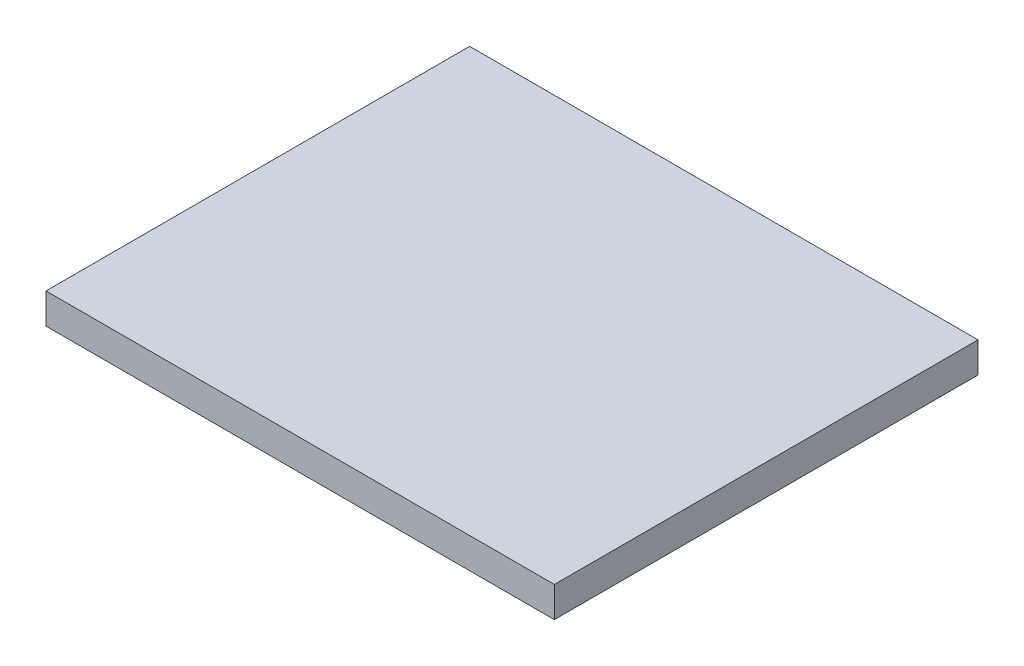
ISO-10303-21;
HEADER;
FILE_DESCRIPTION(('STEP AP214'),'2;1');
FILE_NAME('part.step','',(''),(''),'','','');
FILE_SCHEMA(('AUTOMOTIVE_DESIGN { 1 0 10303 214 1 1 1 1 }'));
ENDSEC;
DATA;
#1=APPLICATION_CONTEXT('core data for automotive mechanical design processes');
#2=APPLICATION_PROTOCOL_DEFINITION('international standard','automotive_design',2000,#1);
#3=PRODUCT_CONTEXT('',#1,'mechanical');
#4=PRODUCT('Part','Part','',(#3));
#5=PRODUCT_RELATED_PRODUCT_CATEGORY('part','',(#4));
#6=PRODUCT_DEFINITION_FORMATION('','',#4);
#7=PRODUCT_DEFINITION_CONTEXT('part definition',#1,'design');
#8=PRODUCT_DEFINITION('design','',#6,#7);
#9=PRODUCT_DEFINITION_SHAPE('','',#8);
#10=(LENGTH_UNIT() NAMED_UNIT(*) SI_UNIT(.MILLI.,.METRE.));
#11=(NAMED_UNIT(*) PLANE_ANGLE_UNIT() SI_UNIT($,.RADIAN.));
#12=(NAMED_UNIT(*) SI_UNIT($,.STERADIAN.) SOLID_ANGLE_UNIT());
#13=UNCERTAINTY_MEASURE_WITH_UNIT(LENGTH_MEASURE(1.E-05),#10,'distance_accuracy_value','');
#14=(GEOMETRIC_REPRESENTATION_CONTEXT(3) GLOBAL_UNCERTAINTY_ASSIGNED_CONTEXT((#13)) GLOBAL_UNIT_ASSIGNED_CONTEXT((#10,
#11,#12)) REPRESENTATION_CONTEXT('',''));
#15=CARTESIAN_POINT('',(0.,0.,0.));
#16=DIRECTION('',(0.,0.,1.));
#17=DIRECTION('',(1.,0.,0.));
#18=AXIS2_PLACEMENT_3D('',#15,#16,#17);
#19=CARTESIAN_POINT('',(-68.0490748205367,18.,-47.6831330731718));
#20=DIRECTION('',(1.,0.,0.));
#21=DIRECTION('',(0.,0.,-1.));
#22=AXIS2_PLACEMENT_3D('',#19,#20,#21);
#23=PLANE('',#22);
#24=DIRECTION('',(0.,0.,1.));
#25=VECTOR('',#24,1.);
#26=CARTESIAN_POINT('',(-68.0490748205367,0.,-47.6831330731718));
#27=LINE('',#26,#25);
#28=CARTESIAN_POINT('',(-68.0490748205367,0.,-47.6831330731718));
#29=VERTEX_POINT('',#28);
#30=CARTESIAN_POINT('',(-68.0490748205367,0.,202.316866926828));
#31=VERTEX_POINT('',#30);
#32=EDGE_CURVE('E95',#29,#31,#27,.T.);
#33=ORIENTED_EDGE('',*,*,#32,.T.);
#34=DIRECTION('',(0.,-1.,0.));
#35=VECTOR('',#34,1.);
#36=CARTESIAN_POINT('',(-68.0490748205367,18.,202.316866926828));
#37=LINE('',#36,#35);
#38=CARTESIAN_POINT('',(-68.0490748205367,18.,202.316866926828));
#39=VERTEX_POINT('',#38);
#40=EDGE_CURVE('E11',#39,#31,#37,.T.);
#41=ORIENTED_EDGE('',*,*,#40,.F.);
#42=DIRECTION('',(0.,0.,1.));
#43=VECTOR('',#42,1.);
#44=CARTESIAN_POINT('',(-68.0490748205367,18.,-47.6831330731718));
#45=LINE('',#44,#43);
#46=CARTESIAN_POINT('',(-68.0490748205367,18.,-47.6831330731718));
#47=VERTEX_POINT('',#46);
#48=EDGE_CURVE('E83',#47,#39,#45,.T.);
#49=ORIENTED_EDGE('',*,*,#48,.F.);
#50=DIRECTION('',(0.,-1.,0.));
#51=VECTOR('',#50,1.);
#52=CARTESIAN_POINT('',(-68.0490748205367,18.,-47.6831330731718));
#53=LINE('',#52,#51);
#54=EDGE_CURVE('E91',#47,#29,#53,.T.);
#55=ORIENTED_EDGE('',*,*,#54,.T.);
#56=EDGE_LOOP('',(#33,#41,#49,#55));
#57=FACE_BOUND('',#56,.T.);
#58=ADVANCED_FACE('F32',(#57),#23,.F.);
#59=CARTESIAN_POINT('',(-68.0490748205367,18.,202.316866926828));
#60=DIRECTION('',(0.,0.,-1.));
#61=DIRECTION('',(-1.,0.,0.));
#62=AXIS2_PLACEMENT_3D('',#59,#60,#61);
#63=PLANE('',#62);
#64=DIRECTION('',(1.,0.,0.));
#65=VECTOR('',#64,1.);
#66=CARTESIAN_POINT('',(-68.0490748205367,0.,202.316866926828));
#67=LINE('',#66,#65);
#68=CARTESIAN_POINT('',(231.950925179463,0.,202.316866926828));
#69=VERTEX_POINT('',#68);
#70=EDGE_CURVE('E87',#31,#69,#67,.T.);
#71=ORIENTED_EDGE('',*,*,#70,.T.);
#72=DIRECTION('',(0.,-1.,0.));
#73=VECTOR('',#72,1.);
#74=CARTESIAN_POINT('',(231.950925179463,18.,202.316866926828));
#75=LINE('',#74,#73);
#76=CARTESIAN_POINT('',(231.950925179463,18.,202.316866926828));
#77=VERTEX_POINT('',#76);
#78=EDGE_CURVE('E40',#77,#69,#75,.T.);
#79=ORIENTED_EDGE('',*,*,#78,.F.);
#80=DIRECTION('',(1.,0.,0.));
#81=VECTOR('',#80,1.);
#82=CARTESIAN_POINT('',(-68.0490748205367,18.,202.316866926828));
#83=LINE('',#82,#81);
#84=EDGE_CURVE('E78',#39,#77,#83,.T.);
#85=ORIENTED_EDGE('',*,*,#84,.F.);
#86=ORIENTED_EDGE('',*,*,#40,.T.);
#87=EDGE_LOOP('',(#71,#79,#85,#86));
#88=FACE_BOUND('',#87,.T.);
#89=ADVANCED_FACE('F86',(#88),#63,.F.);
#90=CARTESIAN_POINT('',(231.950925179463,18.,-47.6831330731718));
#91=DIRECTION('',(-1.,0.,0.));
#92=DIRECTION('',(0.,0.,1.));
#93=AXIS2_PLACEMENT_3D('',#90,#91,#92);
#94=PLANE('',#93);
#95=DIRECTION('',(0.,0.,-1.));
#96=VECTOR('',#95,1.);
#97=CARTESIAN_POINT('',(231.950925179463,0.,-47.6831330731718));
#98=LINE('',#97,#96);
#99=CARTESIAN_POINT('',(231.950925179463,0.,-47.6831330731718));
#100=VERTEX_POINT('',#99);
#101=EDGE_CURVE('E65',#69,#100,#98,.T.);
#102=ORIENTED_EDGE('',*,*,#101,.T.);
#103=DIRECTION('',(0.,-1.,0.));
#104=VECTOR('',#103,1.);
#105=CARTESIAN_POINT('',(231.950925179463,18.,-47.6831330731718));
#106=LINE('',#105,#104);
#107=CARTESIAN_POINT('',(231.950925179463,18.,-47.6831330731718));
#108=VERTEX_POINT('',#107);
#109=EDGE_CURVE('E88',#108,#100,#106,.T.);
#110=ORIENTED_EDGE('',*,*,#109,.F.);
#111=DIRECTION('',(0.,0.,-1.));
#112=VECTOR('',#111,1.);
#113=CARTESIAN_POINT('',(231.950925179463,18.,-47.6831330731718));
#114=LINE('',#113,#112);
#115=EDGE_CURVE('E81',#77,#108,#114,.T.);
#116=ORIENTED_EDGE('',*,*,#115,.F.);
#117=ORIENTED_EDGE('',*,*,#78,.T.);
#118=EDGE_LOOP('',(#102,#110,#116,#117));
#119=FACE_BOUND('',#118,.T.);
#120=ADVANCED_FACE('F89',(#119),#94,.F.);
#121=CARTESIAN_POINT('',(-68.0490748205367,18.,-47.6831330731718));
#122=DIRECTION('',(0.,0.,1.));
#123=DIRECTION('',(1.,0.,0.));
#124=AXIS2_PLACEMENT_3D('',#121,#122,#123);
#125=PLANE('',#124);
#126=DIRECTION('',(-1.,0.,0.));
#127=VECTOR('',#126,1.);
#128=CARTESIAN_POINT('',(-68.0490748205367,0.,-47.6831330731718));
#129=LINE('',#128,#127);
#130=EDGE_CURVE('E71',#100,#29,#129,.T.);
#131=ORIENTED_EDGE('',*,*,#130,.T.);
#132=ORIENTED_EDGE('',*,*,#54,.F.);
#133=DIRECTION('',(-1.,0.,0.));
#134=VECTOR('',#133,1.);
#135=CARTESIAN_POINT('',(-68.0490748205367,18.,-47.6831330731718));
#136=LINE('',#135,#134);
#137=EDGE_CURVE('E48',#108,#47,#136,.T.);
#138=ORIENTED_EDGE('',*,*,#137,.F.);
#139=ORIENTED_EDGE('',*,*,#109,.T.);
#140=EDGE_LOOP('',(#131,#132,#138,#139));
#141=FACE_BOUND('',#140,.T.);
#142=ADVANCED_FACE('F102',(#141),#125,.F.);
#143=CARTESIAN_POINT('',(0.,18.,0.));
#144=DIRECTION('',(0.,1.,0.));
#145=DIRECTION('',(0.,0.,1.));
#146=AXIS2_PLACEMENT_3D('',#143,#144,#145);
#147=PLANE('',#146);
#148=ORIENTED_EDGE('',*,*,#48,.T.);
#149=ORIENTED_EDGE('',*,*,#84,.T.);
#150=ORIENTED_EDGE('',*,*,#115,.T.);
#151=ORIENTED_EDGE('',*,*,#137,.T.);
#152=EDGE_LOOP('',(#148,#149,#150,#151));
#153=FACE_BOUND('',#152,.T.);
#154=ADVANCED_FACE('F79',(#153),#147,.T.);
#155=CARTESIAN_POINT('',(0.,0.,0.));
#156=DIRECTION('',(0.,1.,0.));
#157=DIRECTION('',(0.,0.,1.));
#158=AXIS2_PLACEMENT_3D('',#155,#156,#157);
#159=PLANE('',#158);
#160=ORIENTED_EDGE('',*,*,#32,.F.);
#161=ORIENTED_EDGE('',*,*,#130,.F.);
#162=ORIENTED_EDGE('',*,*,#101,.F.);
#163=ORIENTED_EDGE('',*,*,#70,.F.);
#164=EDGE_LOOP('',(#160,#161,#162,#163));
#165=FACE_BOUND('',#164,.T.);
#166=ADVANCED_FACE('F105',(#165),#159,.F.);
#167=CLOSED_SHELL('',(#58,#89,#120,#142,#154,#166));
#168=MANIFOLD_SOLID_BREP('B2',#167);
#169=ADVANCED_BREP_SHAPE_REPRESENTATION('',(#18,#168),#14);
#170=SHAPE_DEFINITION_REPRESENTATION(#9,#169);
ENDSEC;
END-ISO-10303-21;
